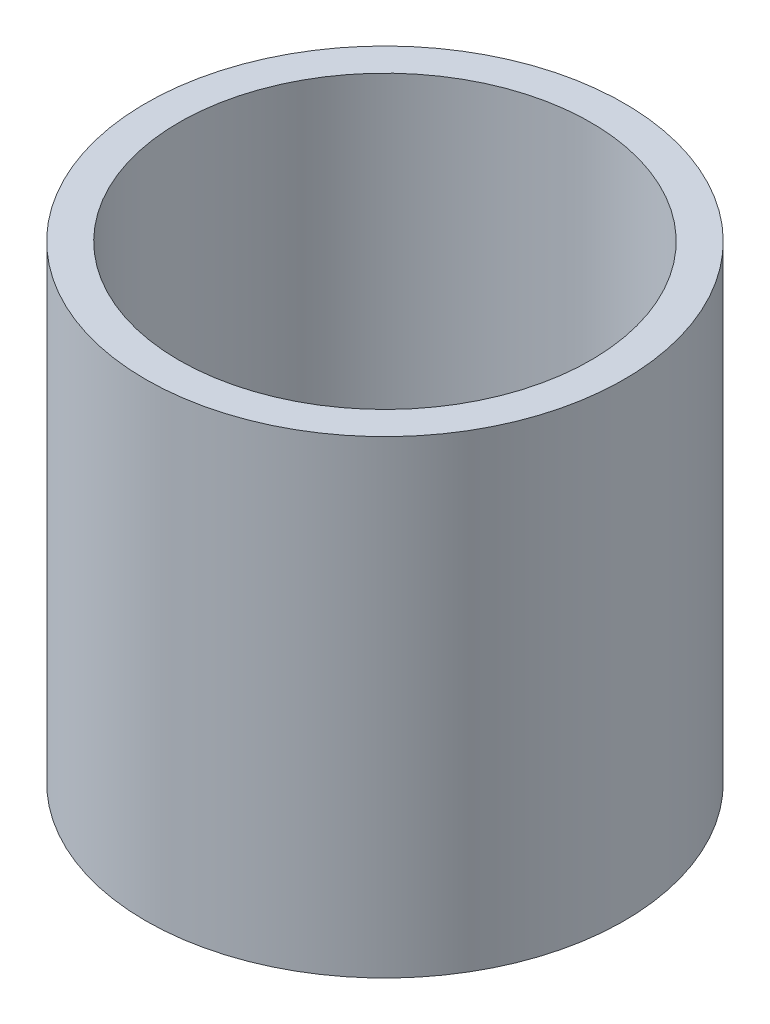
ISO-10303-21;
HEADER;
FILE_DESCRIPTION(('STEP AP214'),'2;1');
FILE_NAME('part.step','',(''),(''),'','','');
FILE_SCHEMA(('AUTOMOTIVE_DESIGN { 1 0 10303 214 1 1 1 1 }'));
ENDSEC;
DATA;
#1=APPLICATION_CONTEXT('core data for automotive mechanical design processes');
#2=APPLICATION_PROTOCOL_DEFINITION('international standard','automotive_design',2000,#1);
#3=PRODUCT_CONTEXT('',#1,'mechanical');
#4=PRODUCT('Part','Part','',(#3));
#5=PRODUCT_RELATED_PRODUCT_CATEGORY('part','',(#4));
#6=PRODUCT_DEFINITION_FORMATION('','',#4);
#7=PRODUCT_DEFINITION_CONTEXT('part definition',#1,'design');
#8=PRODUCT_DEFINITION('design','',#6,#7);
#9=PRODUCT_DEFINITION_SHAPE('','',#8);
#10=(LENGTH_UNIT() NAMED_UNIT(*) SI_UNIT(.MILLI.,.METRE.));
#11=(NAMED_UNIT(*) PLANE_ANGLE_UNIT() SI_UNIT($,.RADIAN.));
#12=(NAMED_UNIT(*) SI_UNIT($,.STERADIAN.) SOLID_ANGLE_UNIT());
#13=UNCERTAINTY_MEASURE_WITH_UNIT(LENGTH_MEASURE(1.E-05),#10,'distance_accuracy_value','');
#14=(GEOMETRIC_REPRESENTATION_CONTEXT(3) GLOBAL_UNCERTAINTY_ASSIGNED_CONTEXT((#13)) GLOBAL_UNIT_ASSIGNED_CONTEXT((#10,
#11,#12)) REPRESENTATION_CONTEXT('',''));
#15=CARTESIAN_POINT('',(0.,0.,0.));
#16=DIRECTION('',(0.,0.,1.));
#17=DIRECTION('',(1.,0.,0.));
#18=AXIS2_PLACEMENT_3D('',#15,#16,#17);
#19=CARTESIAN_POINT('',(0.,53.8997142516225,0.));
#20=DIRECTION('',(0.,-1.,0.));
#21=DIRECTION('',(0.,0.,-1.));
#22=AXIS2_PLACEMENT_3D('',#19,#20,#21);
#23=CYLINDRICAL_SURFACE('',#22,27.5);
#24=CARTESIAN_POINT('',(0.,53.8997142516225,0.));
#25=DIRECTION('',(0.,1.,0.));
#26=DIRECTION('',(0.,0.,1.));
#27=AXIS2_PLACEMENT_3D('',#24,#25,#26);
#28=CIRCLE('',#27,27.5);
#29=CARTESIAN_POINT('',(0.,53.8997142516225,27.5));
#30=VERTEX_POINT('',#29);
#31=EDGE_CURVE('E10',#30,#30,#28,.T.);
#32=ORIENTED_EDGE('',*,*,#31,.F.);
#33=EDGE_LOOP('',(#32));
#34=FACE_BOUND('',#33,.T.);
#35=CARTESIAN_POINT('',(0.,0.,0.));
#36=DIRECTION('',(0.,1.,0.));
#37=DIRECTION('',(0.,0.,1.));
#38=AXIS2_PLACEMENT_3D('',#35,#36,#37);
#39=CIRCLE('',#38,27.5);
#40=CARTESIAN_POINT('',(0.,0.,27.5));
#41=VERTEX_POINT('',#40);
#42=EDGE_CURVE('E37',#41,#41,#39,.T.);
#43=ORIENTED_EDGE('',*,*,#42,.T.);
#44=EDGE_LOOP('',(#43));
#45=FACE_BOUND('',#44,.T.);
#46=ADVANCED_FACE('F40',(#34,#45),#23,.T.);
#47=CARTESIAN_POINT('',(0.,53.8997142516225,0.));
#48=DIRECTION('',(0.,1.,0.));
#49=DIRECTION('',(0.,0.,1.));
#50=AXIS2_PLACEMENT_3D('',#47,#48,#49);
#51=PLANE('',#50);
#52=CARTESIAN_POINT('',(0.,53.8997142516225,0.));
#53=DIRECTION('',(0.,1.,0.));
#54=DIRECTION('',(0.,0.,1.));
#55=AXIS2_PLACEMENT_3D('',#52,#53,#54);
#56=CIRCLE('',#55,23.6748504781394);
#57=CARTESIAN_POINT('',(0.,53.8997142516225,23.6748504781394));
#58=VERTEX_POINT('',#57);
#59=EDGE_CURVE('E50',#58,#58,#56,.T.);
#60=ORIENTED_EDGE('',*,*,#59,.F.);
#61=EDGE_LOOP('',(#60));
#62=FACE_BOUND('',#61,.T.);
#63=ORIENTED_EDGE('',*,*,#31,.T.);
#64=EDGE_LOOP('',(#63));
#65=FACE_BOUND('',#64,.T.);
#66=ADVANCED_FACE('F59',(#62,#65),#51,.T.);
#67=CARTESIAN_POINT('',(0.,0.,0.));
#68=DIRECTION('',(0.,1.,0.));
#69=DIRECTION('',(0.,0.,1.));
#70=AXIS2_PLACEMENT_3D('',#67,#68,#69);
#71=PLANE('',#70);
#72=CARTESIAN_POINT('',(0.,0.,0.));
#73=DIRECTION('',(0.,1.,0.));
#74=DIRECTION('',(0.,0.,1.));
#75=AXIS2_PLACEMENT_3D('',#72,#73,#74);
#76=CIRCLE('',#75,23.6748504781394);
#77=CARTESIAN_POINT('',(0.,0.,23.6748504781394));
#78=VERTEX_POINT('',#77);
#79=EDGE_CURVE('E47',#78,#78,#76,.T.);
#80=ORIENTED_EDGE('',*,*,#79,.T.);
#81=EDGE_LOOP('',(#80));
#82=FACE_BOUND('',#81,.T.);
#83=ORIENTED_EDGE('',*,*,#42,.F.);
#84=EDGE_LOOP('',(#83));
#85=FACE_BOUND('',#84,.T.);
#86=ADVANCED_FACE('F58',(#82,#85),#71,.F.);
#87=CARTESIAN_POINT('',(0.,53.8997142516225,0.));
#88=DIRECTION('',(0.,-1.,0.));
#89=DIRECTION('',(0.,0.,-1.));
#90=AXIS2_PLACEMENT_3D('',#87,#88,#89);
#91=CYLINDRICAL_SURFACE('',#90,23.6748504781394);
#92=ORIENTED_EDGE('',*,*,#59,.T.);
#93=EDGE_LOOP('',(#92));
#94=FACE_BOUND('',#93,.T.);
#95=ORIENTED_EDGE('',*,*,#79,.F.);
#96=EDGE_LOOP('',(#95));
#97=FACE_BOUND('',#96,.T.);
#98=ADVANCED_FACE('F54',(#94,#97),#91,.F.);
#99=CLOSED_SHELL('',(#46,#66,#86,#98));
#100=MANIFOLD_SOLID_BREP('B2',#99);
#101=ADVANCED_BREP_SHAPE_REPRESENTATION('',(#18,#100),#14);
#102=SHAPE_DEFINITION_REPRESENTATION(#9,#101);
ENDSEC;
END-ISO-10303-21;
